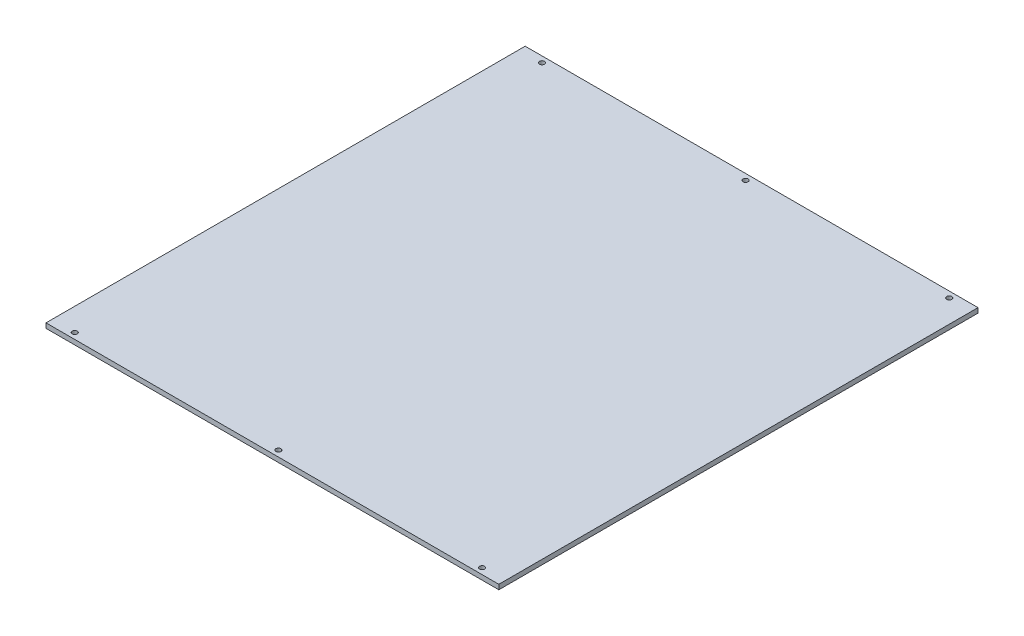
ISO-10303-21;
HEADER;
FILE_DESCRIPTION(('STEP AP214'),'2;1');
FILE_NAME('part.step','',(''),(''),'','','');
FILE_SCHEMA(('AUTOMOTIVE_DESIGN { 1 0 10303 214 1 1 1 1 }'));
ENDSEC;
DATA;
#1=APPLICATION_CONTEXT('core data for automotive mechanical design processes');
#2=APPLICATION_PROTOCOL_DEFINITION('international standard','automotive_design',2000,#1);
#3=PRODUCT_CONTEXT('',#1,'mechanical');
#4=PRODUCT('Part','Part','',(#3));
#5=PRODUCT_RELATED_PRODUCT_CATEGORY('part','',(#4));
#6=PRODUCT_DEFINITION_FORMATION('','',#4);
#7=PRODUCT_DEFINITION_CONTEXT('part definition',#1,'design');
#8=PRODUCT_DEFINITION('design','',#6,#7);
#9=PRODUCT_DEFINITION_SHAPE('','',#8);
#10=(LENGTH_UNIT() NAMED_UNIT(*) SI_UNIT(.MILLI.,.METRE.));
#11=(NAMED_UNIT(*) PLANE_ANGLE_UNIT() SI_UNIT($,.RADIAN.));
#12=(NAMED_UNIT(*) SI_UNIT($,.STERADIAN.) SOLID_ANGLE_UNIT());
#13=UNCERTAINTY_MEASURE_WITH_UNIT(LENGTH_MEASURE(1.E-05),#10,'distance_accuracy_value','');
#14=(GEOMETRIC_REPRESENTATION_CONTEXT(3) GLOBAL_UNCERTAINTY_ASSIGNED_CONTEXT((#13)) GLOBAL_UNIT_ASSIGNED_CONTEXT((#10,
#11,#12)) REPRESENTATION_CONTEXT('',''));
#15=CARTESIAN_POINT('',(0.,0.,0.));
#16=DIRECTION('',(0.,0.,1.));
#17=DIRECTION('',(1.,0.,0.));
#18=AXIS2_PLACEMENT_3D('',#15,#16,#17);
#19=CARTESIAN_POINT('',(-334.329837330477,-8.,-186.940084540823));
#20=DIRECTION('',(0.,1.,0.));
#21=DIRECTION('',(0.,0.,1.));
#22=AXIS2_PLACEMENT_3D('',#19,#20,#21);
#23=CYLINDRICAL_SURFACE('',#22,1.04999999999997);
#24=CARTESIAN_POINT('',(-334.329837330477,2.,-186.940084540823));
#25=DIRECTION('',(0.,1.,0.));
#26=DIRECTION('',(0.,0.,1.));
#27=AXIS2_PLACEMENT_3D('',#24,#25,#26);
#28=CIRCLE('',#27,1.04999999999997);
#29=CARTESIAN_POINT('',(-334.329837330477,2.,-185.890084540823));
#30=VERTEX_POINT('',#29);
#31=EDGE_CURVE('E47',#30,#30,#28,.T.);
#32=ORIENTED_EDGE('',*,*,#31,.T.);
#33=EDGE_LOOP('',(#32));
#34=FACE_BOUND('',#33,.T.);
#35=CARTESIAN_POINT('',(-334.329837330477,0.,-186.940084540823));
#36=DIRECTION('',(0.,1.,0.));
#37=DIRECTION('',(0.,0.,1.));
#38=AXIS2_PLACEMENT_3D('',#35,#36,#37);
#39=CIRCLE('',#38,1.04999999999997);
#40=CARTESIAN_POINT('',(-334.329837330477,0.,-185.890084540823));
#41=VERTEX_POINT('',#40);
#42=EDGE_CURVE('E11',#41,#41,#39,.T.);
#43=ORIENTED_EDGE('',*,*,#42,.F.);
#44=EDGE_LOOP('',(#43));
#45=FACE_BOUND('',#44,.T.);
#46=ADVANCED_FACE('F39',(#34,#45),#23,.F.);
#47=CARTESIAN_POINT('',(-334.329837330477,-8.,8.05991545917689));
#48=DIRECTION('',(0.,1.,0.));
#49=DIRECTION('',(0.,0.,1.));
#50=AXIS2_PLACEMENT_3D('',#47,#48,#49);
#51=CYLINDRICAL_SURFACE('',#50,1.04999999999997);
#52=CARTESIAN_POINT('',(-334.329837330477,2.,8.05991545917689));
#53=DIRECTION('',(0.,1.,0.));
#54=DIRECTION('',(0.,0.,1.));
#55=AXIS2_PLACEMENT_3D('',#52,#53,#54);
#56=CIRCLE('',#55,1.04999999999997);
#57=CARTESIAN_POINT('',(-334.329837330477,2.,9.10991545917686));
#58=VERTEX_POINT('',#57);
#59=EDGE_CURVE('E132',#58,#58,#56,.T.);
#60=ORIENTED_EDGE('',*,*,#59,.T.);
#61=EDGE_LOOP('',(#60));
#62=FACE_BOUND('',#61,.T.);
#63=CARTESIAN_POINT('',(-334.329837330477,0.,8.05991545917689));
#64=DIRECTION('',(0.,1.,0.));
#65=DIRECTION('',(0.,0.,1.));
#66=AXIS2_PLACEMENT_3D('',#63,#64,#65);
#67=CIRCLE('',#66,1.04999999999997);
#68=CARTESIAN_POINT('',(-334.329837330477,0.,9.10991545917686));
#69=VERTEX_POINT('',#68);
#70=EDGE_CURVE('E135',#69,#69,#67,.T.);
#71=ORIENTED_EDGE('',*,*,#70,.F.);
#72=EDGE_LOOP('',(#71));
#73=FACE_BOUND('',#72,.T.);
#74=ADVANCED_FACE('F160',(#62,#73),#51,.F.);
#75=CARTESIAN_POINT('',(-419.329837330477,-8.,-186.940084540823));
#76=DIRECTION('',(0.,1.,0.));
#77=DIRECTION('',(0.,0.,1.));
#78=AXIS2_PLACEMENT_3D('',#75,#76,#77);
#79=CYLINDRICAL_SURFACE('',#78,1.04999999999997);
#80=CARTESIAN_POINT('',(-419.329837330477,2.,-186.940084540823));
#81=DIRECTION('',(0.,1.,0.));
#82=DIRECTION('',(0.,0.,1.));
#83=AXIS2_PLACEMENT_3D('',#80,#81,#82);
#84=CIRCLE('',#83,1.04999999999997);
#85=CARTESIAN_POINT('',(-419.329837330477,2.,-185.890084540823));
#86=VERTEX_POINT('',#85);
#87=EDGE_CURVE('E126',#86,#86,#84,.T.);
#88=ORIENTED_EDGE('',*,*,#87,.T.);
#89=EDGE_LOOP('',(#88));
#90=FACE_BOUND('',#89,.T.);
#91=CARTESIAN_POINT('',(-419.329837330477,0.,-186.940084540823));
#92=DIRECTION('',(0.,1.,0.));
#93=DIRECTION('',(0.,0.,1.));
#94=AXIS2_PLACEMENT_3D('',#91,#92,#93);
#95=CIRCLE('',#94,1.04999999999997);
#96=CARTESIAN_POINT('',(-419.329837330477,0.,-185.890084540823));
#97=VERTEX_POINT('',#96);
#98=EDGE_CURVE('E129',#97,#97,#95,.T.);
#99=ORIENTED_EDGE('',*,*,#98,.F.);
#100=EDGE_LOOP('',(#99));
#101=FACE_BOUND('',#100,.T.);
#102=ADVANCED_FACE('F165',(#90,#101),#79,.F.);
#103=CARTESIAN_POINT('',(-419.329837330477,-8.,8.05991545917689));
#104=DIRECTION('',(0.,1.,0.));
#105=DIRECTION('',(0.,0.,1.));
#106=AXIS2_PLACEMENT_3D('',#103,#104,#105);
#107=CYLINDRICAL_SURFACE('',#106,1.04999999999997);
#108=CARTESIAN_POINT('',(-419.329837330477,2.,8.05991545917689));
#109=DIRECTION('',(0.,1.,0.));
#110=DIRECTION('',(0.,0.,1.));
#111=AXIS2_PLACEMENT_3D('',#108,#109,#110);
#112=CIRCLE('',#111,1.04999999999997);
#113=CARTESIAN_POINT('',(-419.329837330477,2.,9.10991545917686));
#114=VERTEX_POINT('',#113);
#115=EDGE_CURVE('E117',#114,#114,#112,.T.);
#116=ORIENTED_EDGE('',*,*,#115,.T.);
#117=EDGE_LOOP('',(#116));
#118=FACE_BOUND('',#117,.T.);
#119=CARTESIAN_POINT('',(-419.329837330477,0.,8.05991545917689));
#120=DIRECTION('',(0.,1.,0.));
#121=DIRECTION('',(0.,0.,1.));
#122=AXIS2_PLACEMENT_3D('',#119,#120,#121);
#123=CIRCLE('',#122,1.04999999999997);
#124=CARTESIAN_POINT('',(-419.329837330477,0.,9.10991545917686));
#125=VERTEX_POINT('',#124);
#126=EDGE_CURVE('E123',#125,#125,#123,.T.);
#127=ORIENTED_EDGE('',*,*,#126,.F.);
#128=EDGE_LOOP('',(#127));
#129=FACE_BOUND('',#128,.T.);
#130=ADVANCED_FACE('F170',(#118,#129),#107,.F.);
#131=CARTESIAN_POINT('',(-513.829837330477,2.,-189.440084540823));
#132=DIRECTION('',(1.,0.,0.));
#133=DIRECTION('',(0.,0.,-1.));
#134=AXIS2_PLACEMENT_3D('',#131,#132,#133);
#135=PLANE('',#134);
#136=DIRECTION('',(0.,0.,1.));
#137=VECTOR('',#136,1.);
#138=CARTESIAN_POINT('',(-513.829837330477,0.,-189.440084540823));
#139=LINE('',#138,#137);
#140=CARTESIAN_POINT('',(-513.829837330477,0.,-189.440084540823));
#141=VERTEX_POINT('',#140);
#142=CARTESIAN_POINT('',(-513.829837330478,0.,10.5599154591769));
#143=VERTEX_POINT('',#142);
#144=EDGE_CURVE('E107',#141,#143,#139,.T.);
#145=ORIENTED_EDGE('',*,*,#144,.T.);
#146=DIRECTION('',(0.,-1.,0.));
#147=VECTOR('',#146,1.);
#148=CARTESIAN_POINT('',(-513.829837330478,2.,10.5599154591769));
#149=LINE('',#148,#147);
#150=CARTESIAN_POINT('',(-513.829837330478,2.,10.5599154591769));
#151=VERTEX_POINT('',#150);
#152=EDGE_CURVE('E98',#151,#143,#149,.T.);
#153=ORIENTED_EDGE('',*,*,#152,.F.);
#154=DIRECTION('',(0.,0.,1.));
#155=VECTOR('',#154,1.);
#156=CARTESIAN_POINT('',(-513.829837330477,2.,-189.440084540823));
#157=LINE('',#156,#155);
#158=CARTESIAN_POINT('',(-513.829837330477,2.,-189.440084540823));
#159=VERTEX_POINT('',#158);
#160=EDGE_CURVE('E92',#159,#151,#157,.T.);
#161=ORIENTED_EDGE('',*,*,#160,.F.);
#162=DIRECTION('',(0.,-1.,0.));
#163=VECTOR('',#162,1.);
#164=CARTESIAN_POINT('',(-513.829837330477,2.,-189.440084540823));
#165=LINE('',#164,#163);
#166=EDGE_CURVE('E103',#159,#141,#165,.T.);
#167=ORIENTED_EDGE('',*,*,#166,.T.);
#168=EDGE_LOOP('',(#145,#153,#161,#167));
#169=FACE_BOUND('',#168,.T.);
#170=ADVANCED_FACE('F177',(#169),#135,.F.);
#171=CARTESIAN_POINT('',(-513.829837330478,2.,10.5599154591769));
#172=DIRECTION('',(0.,0.,-1.));
#173=DIRECTION('',(-1.,0.,0.));
#174=AXIS2_PLACEMENT_3D('',#171,#172,#173);
#175=PLANE('',#174);
#176=DIRECTION('',(1.,0.,0.));
#177=VECTOR('',#176,1.);
#178=CARTESIAN_POINT('',(-513.829837330478,0.,10.5599154591769));
#179=LINE('',#178,#177);
#180=CARTESIAN_POINT('',(-324.829837330477,0.,10.5599154591769));
#181=VERTEX_POINT('',#180);
#182=EDGE_CURVE('E97',#143,#181,#179,.T.);
#183=ORIENTED_EDGE('',*,*,#182,.T.);
#184=DIRECTION('',(0.,-1.,0.));
#185=VECTOR('',#184,1.);
#186=CARTESIAN_POINT('',(-324.829837330477,2.,10.5599154591769));
#187=LINE('',#186,#185);
#188=CARTESIAN_POINT('',(-324.829837330477,2.,10.5599154591769));
#189=VERTEX_POINT('',#188);
#190=EDGE_CURVE('E95',#189,#181,#187,.T.);
#191=ORIENTED_EDGE('',*,*,#190,.F.);
#192=DIRECTION('',(1.,0.,0.));
#193=VECTOR('',#192,1.);
#194=CARTESIAN_POINT('',(-513.829837330478,2.,10.5599154591769));
#195=LINE('',#194,#193);
#196=EDGE_CURVE('E86',#151,#189,#195,.T.);
#197=ORIENTED_EDGE('',*,*,#196,.F.);
#198=ORIENTED_EDGE('',*,*,#152,.T.);
#199=EDGE_LOOP('',(#183,#191,#197,#198));
#200=FACE_BOUND('',#199,.T.);
#201=ADVANCED_FACE('F96',(#200),#175,.F.);
#202=CARTESIAN_POINT('',(-324.829837330477,2.,-189.440084540823));
#203=DIRECTION('',(-1.,0.,0.));
#204=DIRECTION('',(0.,0.,1.));
#205=AXIS2_PLACEMENT_3D('',#202,#203,#204);
#206=PLANE('',#205);
#207=DIRECTION('',(0.,0.,-1.));
#208=VECTOR('',#207,1.);
#209=CARTESIAN_POINT('',(-324.829837330477,0.,-189.440084540823));
#210=LINE('',#209,#208);
#211=CARTESIAN_POINT('',(-324.829837330477,0.,-189.440084540823));
#212=VERTEX_POINT('',#211);
#213=EDGE_CURVE('E72',#181,#212,#210,.T.);
#214=ORIENTED_EDGE('',*,*,#213,.T.);
#215=DIRECTION('',(0.,-1.,0.));
#216=VECTOR('',#215,1.);
#217=CARTESIAN_POINT('',(-324.829837330477,2.,-189.440084540823));
#218=LINE('',#217,#216);
#219=CARTESIAN_POINT('',(-324.829837330477,2.,-189.440084540823));
#220=VERTEX_POINT('',#219);
#221=EDGE_CURVE('E99',#220,#212,#218,.T.);
#222=ORIENTED_EDGE('',*,*,#221,.F.);
#223=DIRECTION('',(0.,0.,-1.));
#224=VECTOR('',#223,1.);
#225=CARTESIAN_POINT('',(-324.829837330477,2.,-189.440084540823));
#226=LINE('',#225,#224);
#227=EDGE_CURVE('E90',#189,#220,#226,.T.);
#228=ORIENTED_EDGE('',*,*,#227,.F.);
#229=ORIENTED_EDGE('',*,*,#190,.T.);
#230=EDGE_LOOP('',(#214,#222,#228,#229));
#231=FACE_BOUND('',#230,.T.);
#232=ADVANCED_FACE('F101',(#231),#206,.F.);
#233=CARTESIAN_POINT('',(-513.829837330477,2.,-189.440084540823));
#234=DIRECTION('',(0.,0.,1.));
#235=DIRECTION('',(1.,0.,0.));
#236=AXIS2_PLACEMENT_3D('',#233,#234,#235);
#237=PLANE('',#236);
#238=DIRECTION('',(-1.,0.,0.));
#239=VECTOR('',#238,1.);
#240=CARTESIAN_POINT('',(-513.829837330477,0.,-189.440084540823));
#241=LINE('',#240,#239);
#242=EDGE_CURVE('E78',#212,#141,#241,.T.);
#243=ORIENTED_EDGE('',*,*,#242,.T.);
#244=ORIENTED_EDGE('',*,*,#166,.F.);
#245=DIRECTION('',(-1.,0.,0.));
#246=VECTOR('',#245,1.);
#247=CARTESIAN_POINT('',(-513.829837330477,2.,-189.440084540823));
#248=LINE('',#247,#246);
#249=EDGE_CURVE('E55',#220,#159,#248,.T.);
#250=ORIENTED_EDGE('',*,*,#249,.F.);
#251=ORIENTED_EDGE('',*,*,#221,.T.);
#252=EDGE_LOOP('',(#243,#244,#250,#251));
#253=FACE_BOUND('',#252,.T.);
#254=ADVANCED_FACE('F144',(#253),#237,.F.);
#255=CARTESIAN_POINT('',(0.,2.,0.));
#256=DIRECTION('',(0.,1.,0.));
#257=DIRECTION('',(0.,0.,1.));
#258=AXIS2_PLACEMENT_3D('',#255,#256,#257);
#259=PLANE('',#258);
#260=CARTESIAN_POINT('',(-504.329837330477,2.,-186.940084540823));
#261=DIRECTION('',(0.,1.,0.));
#262=DIRECTION('',(0.,0.,1.));
#263=AXIS2_PLACEMENT_3D('',#260,#261,#262);
#264=CIRCLE('',#263,1.04999999999997);
#265=CARTESIAN_POINT('',(-504.329837330477,2.,-185.890084540823));
#266=VERTEX_POINT('',#265);
#267=EDGE_CURVE('E301',#266,#266,#264,.T.);
#268=ORIENTED_EDGE('',*,*,#267,.F.);
#269=EDGE_LOOP('',(#268));
#270=FACE_BOUND('',#269,.T.);
#271=CARTESIAN_POINT('',(-504.329837330477,2.,8.05991545917689));
#272=DIRECTION('',(0.,1.,0.));
#273=DIRECTION('',(0.,0.,1.));
#274=AXIS2_PLACEMENT_3D('',#271,#272,#273);
#275=CIRCLE('',#274,1.04999999999997);
#276=CARTESIAN_POINT('',(-504.329837330477,2.,9.10991545917686));
#277=VERTEX_POINT('',#276);
#278=EDGE_CURVE('E120',#277,#277,#275,.T.);
#279=ORIENTED_EDGE('',*,*,#278,.F.);
#280=EDGE_LOOP('',(#279));
#281=FACE_BOUND('',#280,.T.);
#282=ORIENTED_EDGE('',*,*,#160,.T.);
#283=ORIENTED_EDGE('',*,*,#196,.T.);
#284=ORIENTED_EDGE('',*,*,#227,.T.);
#285=ORIENTED_EDGE('',*,*,#249,.T.);
#286=EDGE_LOOP('',(#282,#283,#284,#285));
#287=FACE_BOUND('',#286,.T.);
#288=ORIENTED_EDGE('',*,*,#115,.F.);
#289=EDGE_LOOP('',(#288));
#290=FACE_BOUND('',#289,.T.);
#291=ORIENTED_EDGE('',*,*,#87,.F.);
#292=EDGE_LOOP('',(#291));
#293=FACE_BOUND('',#292,.T.);
#294=ORIENTED_EDGE('',*,*,#59,.F.);
#295=EDGE_LOOP('',(#294));
#296=FACE_BOUND('',#295,.T.);
#297=ORIENTED_EDGE('',*,*,#31,.F.);
#298=EDGE_LOOP('',(#297));
#299=FACE_BOUND('',#298,.T.);
#300=ADVANCED_FACE('F87',(#270,#281,#287,#290,#293,#296,#299),#259,.T.);
#301=CARTESIAN_POINT('',(0.,0.,0.));
#302=DIRECTION('',(0.,1.,0.));
#303=DIRECTION('',(0.,0.,1.));
#304=AXIS2_PLACEMENT_3D('',#301,#302,#303);
#305=PLANE('',#304);
#306=CARTESIAN_POINT('',(-504.329837330477,0.,-186.940084540823));
#307=DIRECTION('',(0.,1.,0.));
#308=DIRECTION('',(0.,0.,1.));
#309=AXIS2_PLACEMENT_3D('',#306,#307,#308);
#310=CIRCLE('',#309,1.04999999999997);
#311=CARTESIAN_POINT('',(-504.329837330477,0.,-185.890084540823));
#312=VERTEX_POINT('',#311);
#313=EDGE_CURVE('E298',#312,#312,#310,.T.);
#314=ORIENTED_EDGE('',*,*,#313,.T.);
#315=EDGE_LOOP('',(#314));
#316=FACE_BOUND('',#315,.T.);
#317=CARTESIAN_POINT('',(-504.329837330477,0.,8.05991545917689));
#318=DIRECTION('',(0.,1.,0.));
#319=DIRECTION('',(0.,0.,1.));
#320=AXIS2_PLACEMENT_3D('',#317,#318,#319);
#321=CIRCLE('',#320,1.04999999999997);
#322=CARTESIAN_POINT('',(-504.329837330477,0.,9.10991545917686));
#323=VERTEX_POINT('',#322);
#324=EDGE_CURVE('E110',#323,#323,#321,.T.);
#325=ORIENTED_EDGE('',*,*,#324,.T.);
#326=EDGE_LOOP('',(#325));
#327=FACE_BOUND('',#326,.T.);
#328=ORIENTED_EDGE('',*,*,#144,.F.);
#329=ORIENTED_EDGE('',*,*,#242,.F.);
#330=ORIENTED_EDGE('',*,*,#213,.F.);
#331=ORIENTED_EDGE('',*,*,#182,.F.);
#332=EDGE_LOOP('',(#328,#329,#330,#331));
#333=FACE_BOUND('',#332,.T.);
#334=ORIENTED_EDGE('',*,*,#126,.T.);
#335=EDGE_LOOP('',(#334));
#336=FACE_BOUND('',#335,.T.);
#337=ORIENTED_EDGE('',*,*,#98,.T.);
#338=EDGE_LOOP('',(#337));
#339=FACE_BOUND('',#338,.T.);
#340=ORIENTED_EDGE('',*,*,#70,.T.);
#341=EDGE_LOOP('',(#340));
#342=FACE_BOUND('',#341,.T.);
#343=ORIENTED_EDGE('',*,*,#42,.T.);
#344=EDGE_LOOP('',(#343));
#345=FACE_BOUND('',#344,.T.);
#346=ADVANCED_FACE('F143',(#316,#327,#333,#336,#339,#342,#345),#305,.F.);
#347=CARTESIAN_POINT('',(-504.329837330477,-8.,8.05991545917689));
#348=DIRECTION('',(0.,1.,0.));
#349=DIRECTION('',(0.,0.,1.));
#350=AXIS2_PLACEMENT_3D('',#347,#348,#349);
#351=CYLINDRICAL_SURFACE('',#350,1.04999999999997);
#352=ORIENTED_EDGE('',*,*,#278,.T.);
#353=EDGE_LOOP('',(#352));
#354=FACE_BOUND('',#353,.T.);
#355=ORIENTED_EDGE('',*,*,#324,.F.);
#356=EDGE_LOOP('',(#355));
#357=FACE_BOUND('',#356,.T.);
#358=ADVANCED_FACE('F151',(#354,#357),#351,.F.);
#359=CARTESIAN_POINT('',(-504.329837330477,-8.,-186.940084540823));
#360=DIRECTION('',(0.,1.,0.));
#361=DIRECTION('',(0.,0.,1.));
#362=AXIS2_PLACEMENT_3D('',#359,#360,#361);
#363=CYLINDRICAL_SURFACE('',#362,1.04999999999997);
#364=ORIENTED_EDGE('',*,*,#267,.T.);
#365=EDGE_LOOP('',(#364));
#366=FACE_BOUND('',#365,.T.);
#367=ORIENTED_EDGE('',*,*,#313,.F.);
#368=EDGE_LOOP('',(#367));
#369=FACE_BOUND('',#368,.T.);
#370=ADVANCED_FACE('F209',(#366,#369),#363,.F.);
#371=CLOSED_SHELL('',(#46,#74,#102,#130,#170,#201,#232,#254,#300,#346,#358,#370));
#372=MANIFOLD_SOLID_BREP('B2',#371);
#373=ADVANCED_BREP_SHAPE_REPRESENTATION('',(#18,#372),#14);
#374=SHAPE_DEFINITION_REPRESENTATION(#9,#373);
ENDSEC;
END-ISO-10303-21;
